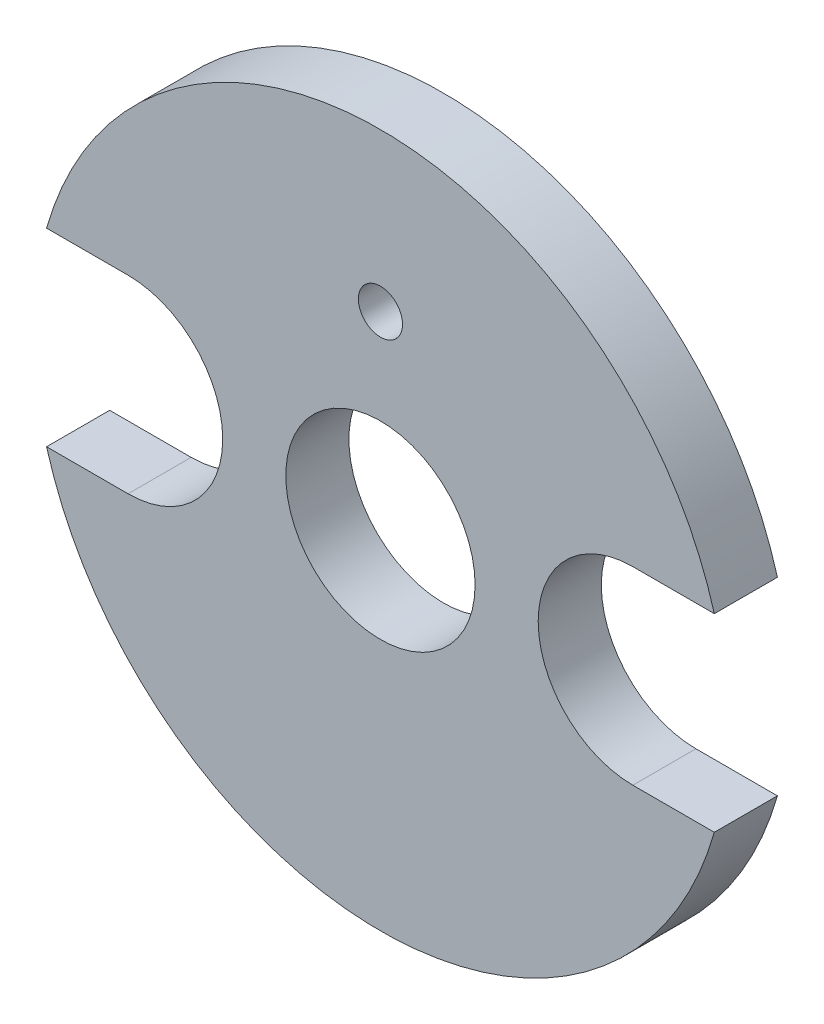
ISO-10303-21;
HEADER;
FILE_DESCRIPTION(('STEP AP214'),'2;1');
FILE_NAME('part.step','',(''),(''),'','','');
FILE_SCHEMA(('AUTOMOTIVE_DESIGN { 1 0 10303 214 1 1 1 1 }'));
ENDSEC;
DATA;
#1=APPLICATION_CONTEXT('core data for automotive mechanical design processes');
#2=APPLICATION_PROTOCOL_DEFINITION('international standard','automotive_design',2000,#1);
#3=PRODUCT_CONTEXT('',#1,'mechanical');
#4=PRODUCT('Part','Part','',(#3));
#5=PRODUCT_RELATED_PRODUCT_CATEGORY('part','',(#4));
#6=PRODUCT_DEFINITION_FORMATION('','',#4);
#7=PRODUCT_DEFINITION_CONTEXT('part definition',#1,'design');
#8=PRODUCT_DEFINITION('design','',#6,#7);
#9=PRODUCT_DEFINITION_SHAPE('','',#8);
#10=(LENGTH_UNIT() NAMED_UNIT(*) SI_UNIT(.MILLI.,.METRE.));
#11=(NAMED_UNIT(*) PLANE_ANGLE_UNIT() SI_UNIT($,.RADIAN.));
#12=(NAMED_UNIT(*) SI_UNIT($,.STERADIAN.) SOLID_ANGLE_UNIT());
#13=UNCERTAINTY_MEASURE_WITH_UNIT(LENGTH_MEASURE(1.E-05),#10,'distance_accuracy_value','');
#14=(GEOMETRIC_REPRESENTATION_CONTEXT(3) GLOBAL_UNCERTAINTY_ASSIGNED_CONTEXT((#13)) GLOBAL_UNIT_ASSIGNED_CONTEXT((#10,
#11,#12)) REPRESENTATION_CONTEXT('',''));
#15=CARTESIAN_POINT('',(0.,0.,0.));
#16=DIRECTION('',(0.,0.,1.));
#17=DIRECTION('',(1.,0.,0.));
#18=AXIS2_PLACEMENT_3D('',#15,#16,#17);
#19=CARTESIAN_POINT('',(0.,0.,2.));
#20=DIRECTION('',(0.,0.,1.));
#21=DIRECTION('',(1.,0.,0.));
#22=AXIS2_PLACEMENT_3D('',#19,#20,#21);
#23=PLANE('',#22);
#24=CARTESIAN_POINT('',(0.,6.,2.));
#25=DIRECTION('',(0.,0.,1.));
#26=DIRECTION('',(1.,0.,0.));
#27=AXIS2_PLACEMENT_3D('',#24,#25,#26);
#28=CIRCLE('',#27,0.699999999999999);
#29=CARTESIAN_POINT('',(0.699999999999999,6.,2.));
#30=VERTEX_POINT('',#29);
#31=EDGE_CURVE('E134',#30,#30,#28,.T.);
#32=ORIENTED_EDGE('',*,*,#31,.F.);
#33=EDGE_LOOP('',(#32));
#34=FACE_BOUND('',#33,.T.);
#35=CARTESIAN_POINT('',(0.,0.,2.));
#36=DIRECTION('',(0.,0.,1.));
#37=DIRECTION('',(1.,0.,0.));
#38=AXIS2_PLACEMENT_3D('',#35,#36,#37);
#39=CIRCLE('',#38,11.);
#40=CARTESIAN_POINT('',(10.5830052442584,3.00000000000011,2.));
#41=VERTEX_POINT('',#40);
#42=CARTESIAN_POINT('',(-10.5830052442584,3.00000000000011,2.));
#43=VERTEX_POINT('',#42);
#44=EDGE_CURVE('E145',#41,#43,#39,.T.);
#45=ORIENTED_EDGE('',*,*,#44,.T.);
#46=DIRECTION('',(1.,0.,0.));
#47=VECTOR('',#46,1.);
#48=CARTESIAN_POINT('',(-8.00000000000001,3.00000000000011,2.));
#49=LINE('',#48,#47);
#50=CARTESIAN_POINT('',(-8.00000000000001,3.,2.));
#51=VERTEX_POINT('',#50);
#52=EDGE_CURVE('E93',#43,#51,#49,.T.);
#53=ORIENTED_EDGE('',*,*,#52,.T.);
#54=CARTESIAN_POINT('',(-8.00000000000001,0.,2.));
#55=DIRECTION('',(0.,0.,-1.));
#56=DIRECTION('',(1.,0.,0.));
#57=AXIS2_PLACEMENT_3D('',#54,#55,#56);
#58=CIRCLE('',#57,3.);
#59=CARTESIAN_POINT('',(-8.00000000000001,-2.99999999999989,2.));
#60=VERTEX_POINT('',#59);
#61=EDGE_CURVE('E160',#51,#60,#58,.T.);
#62=ORIENTED_EDGE('',*,*,#61,.T.);
#63=DIRECTION('',(-1.,0.,0.));
#64=VECTOR('',#63,1.);
#65=CARTESIAN_POINT('',(-8.00000000000001,-2.99999999999989,2.));
#66=LINE('',#65,#64);
#67=CARTESIAN_POINT('',(-10.5830052442584,-2.99999999999989,2.));
#68=VERTEX_POINT('',#67);
#69=EDGE_CURVE('E173',#60,#68,#66,.T.);
#70=ORIENTED_EDGE('',*,*,#69,.T.);
#71=CARTESIAN_POINT('',(0.,0.,2.));
#72=DIRECTION('',(0.,0.,1.));
#73=DIRECTION('',(1.,0.,0.));
#74=AXIS2_PLACEMENT_3D('',#71,#72,#73);
#75=CIRCLE('',#74,11.);
#76=CARTESIAN_POINT('',(10.5830052442584,-2.99999999999989,2.));
#77=VERTEX_POINT('',#76);
#78=EDGE_CURVE('E112',#68,#77,#75,.T.);
#79=ORIENTED_EDGE('',*,*,#78,.T.);
#80=DIRECTION('',(-1.,0.,0.));
#81=VECTOR('',#80,1.);
#82=CARTESIAN_POINT('',(8.00000000000001,-2.99999999999989,2.));
#83=LINE('',#82,#81);
#84=CARTESIAN_POINT('',(8.00000000000001,-3.,2.));
#85=VERTEX_POINT('',#84);
#86=EDGE_CURVE('E106',#77,#85,#83,.T.);
#87=ORIENTED_EDGE('',*,*,#86,.T.);
#88=CARTESIAN_POINT('',(8.00000000000001,0.,2.));
#89=DIRECTION('',(0.,0.,-1.));
#90=DIRECTION('',(1.,0.,0.));
#91=AXIS2_PLACEMENT_3D('',#88,#89,#90);
#92=CIRCLE('',#91,3.);
#93=CARTESIAN_POINT('',(8.00000000000001,3.00000000000011,2.));
#94=VERTEX_POINT('',#93);
#95=EDGE_CURVE('E110',#85,#94,#92,.T.);
#96=ORIENTED_EDGE('',*,*,#95,.T.);
#97=DIRECTION('',(1.,0.,0.));
#98=VECTOR('',#97,1.);
#99=CARTESIAN_POINT('',(8.00000000000001,3.00000000000011,2.));
#100=LINE('',#99,#98);
#101=EDGE_CURVE('E50',#94,#41,#100,.T.);
#102=ORIENTED_EDGE('',*,*,#101,.T.);
#103=EDGE_LOOP('',(#45,#53,#62,#70,#79,#87,#96,#102));
#104=FACE_BOUND('',#103,.T.);
#105=CARTESIAN_POINT('',(0.,0.,2.));
#106=DIRECTION('',(0.,0.,1.));
#107=DIRECTION('',(1.,0.,0.));
#108=AXIS2_PLACEMENT_3D('',#105,#106,#107);
#109=CIRCLE('',#108,3.00000000000011);
#110=CARTESIAN_POINT('',(3.00000000000011,0.,2.));
#111=VERTEX_POINT('',#110);
#112=EDGE_CURVE('E182',#111,#111,#109,.T.);
#113=ORIENTED_EDGE('',*,*,#112,.F.);
#114=EDGE_LOOP('',(#113));
#115=FACE_BOUND('',#114,.T.);
#116=ADVANCED_FACE('F33',(#34,#104,#115),#23,.T.);
#117=CARTESIAN_POINT('',(0.,0.,0.));
#118=DIRECTION('',(0.,0.,1.));
#119=DIRECTION('',(1.,0.,0.));
#120=AXIS2_PLACEMENT_3D('',#117,#118,#119);
#121=PLANE('',#120);
#122=CARTESIAN_POINT('',(0.,6.,0.));
#123=DIRECTION('',(0.,0.,1.));
#124=DIRECTION('',(1.,0.,0.));
#125=AXIS2_PLACEMENT_3D('',#122,#123,#124);
#126=CIRCLE('',#125,0.699999999999999);
#127=CARTESIAN_POINT('',(0.699999999999999,6.,0.));
#128=VERTEX_POINT('',#127);
#129=EDGE_CURVE('E179',#128,#128,#126,.T.);
#130=ORIENTED_EDGE('',*,*,#129,.T.);
#131=EDGE_LOOP('',(#130));
#132=FACE_BOUND('',#131,.T.);
#133=CARTESIAN_POINT('',(0.,0.,0.));
#134=DIRECTION('',(0.,0.,1.));
#135=DIRECTION('',(1.,0.,0.));
#136=AXIS2_PLACEMENT_3D('',#133,#134,#135);
#137=CIRCLE('',#136,11.);
#138=CARTESIAN_POINT('',(10.5830052442584,3.00000000000011,0.));
#139=VERTEX_POINT('',#138);
#140=CARTESIAN_POINT('',(-10.5830052442584,3.00000000000011,0.));
#141=VERTEX_POINT('',#140);
#142=EDGE_CURVE('E130',#139,#141,#137,.T.);
#143=ORIENTED_EDGE('',*,*,#142,.F.);
#144=DIRECTION('',(1.,0.,0.));
#145=VECTOR('',#144,1.);
#146=CARTESIAN_POINT('',(8.00000000000001,3.00000000000011,0.));
#147=LINE('',#146,#145);
#148=CARTESIAN_POINT('',(8.00000000000001,3.00000000000011,0.));
#149=VERTEX_POINT('',#148);
#150=EDGE_CURVE('E85',#149,#139,#147,.T.);
#151=ORIENTED_EDGE('',*,*,#150,.F.);
#152=CARTESIAN_POINT('',(8.00000000000001,0.,0.));
#153=DIRECTION('',(0.,0.,-1.));
#154=DIRECTION('',(1.,0.,0.));
#155=AXIS2_PLACEMENT_3D('',#152,#153,#154);
#156=CIRCLE('',#155,3.);
#157=CARTESIAN_POINT('',(8.00000000000001,-3.,0.));
#158=VERTEX_POINT('',#157);
#159=EDGE_CURVE('E79',#158,#149,#156,.T.);
#160=ORIENTED_EDGE('',*,*,#159,.F.);
#161=DIRECTION('',(-1.,0.,0.));
#162=VECTOR('',#161,1.);
#163=CARTESIAN_POINT('',(8.00000000000001,-2.99999999999989,0.));
#164=LINE('',#163,#162);
#165=CARTESIAN_POINT('',(10.5830052442584,-2.99999999999989,0.));
#166=VERTEX_POINT('',#165);
#167=EDGE_CURVE('E120',#166,#158,#164,.T.);
#168=ORIENTED_EDGE('',*,*,#167,.F.);
#169=CARTESIAN_POINT('',(0.,0.,0.));
#170=DIRECTION('',(0.,0.,1.));
#171=DIRECTION('',(1.,0.,0.));
#172=AXIS2_PLACEMENT_3D('',#169,#170,#171);
#173=CIRCLE('',#172,11.);
#174=CARTESIAN_POINT('',(-10.5830052442584,-2.99999999999989,0.));
#175=VERTEX_POINT('',#174);
#176=EDGE_CURVE('E140',#175,#166,#173,.T.);
#177=ORIENTED_EDGE('',*,*,#176,.F.);
#178=DIRECTION('',(-1.,0.,0.));
#179=VECTOR('',#178,1.);
#180=CARTESIAN_POINT('',(-8.00000000000001,-2.99999999999989,0.));
#181=LINE('',#180,#179);
#182=CARTESIAN_POINT('',(-8.00000000000001,-2.99999999999989,0.));
#183=VERTEX_POINT('',#182);
#184=EDGE_CURVE('E138',#183,#175,#181,.T.);
#185=ORIENTED_EDGE('',*,*,#184,.F.);
#186=CARTESIAN_POINT('',(-8.00000000000001,0.,0.));
#187=DIRECTION('',(0.,0.,-1.));
#188=DIRECTION('',(1.,0.,0.));
#189=AXIS2_PLACEMENT_3D('',#186,#187,#188);
#190=CIRCLE('',#189,3.);
#191=CARTESIAN_POINT('',(-8.00000000000001,3.,0.));
#192=VERTEX_POINT('',#191);
#193=EDGE_CURVE('E136',#192,#183,#190,.T.);
#194=ORIENTED_EDGE('',*,*,#193,.F.);
#195=DIRECTION('',(1.,0.,0.));
#196=VECTOR('',#195,1.);
#197=CARTESIAN_POINT('',(-8.00000000000001,3.00000000000011,0.));
#198=LINE('',#197,#196);
#199=EDGE_CURVE('E133',#141,#192,#198,.T.);
#200=ORIENTED_EDGE('',*,*,#199,.F.);
#201=EDGE_LOOP('',(#143,#151,#160,#168,#177,#185,#194,#200));
#202=FACE_BOUND('',#201,.T.);
#203=CARTESIAN_POINT('',(0.,0.,0.));
#204=DIRECTION('',(0.,0.,1.));
#205=DIRECTION('',(1.,0.,0.));
#206=AXIS2_PLACEMENT_3D('',#203,#204,#205);
#207=CIRCLE('',#206,3.00000000000011);
#208=CARTESIAN_POINT('',(3.00000000000011,0.,0.));
#209=VERTEX_POINT('',#208);
#210=EDGE_CURVE('E185',#209,#209,#207,.T.);
#211=ORIENTED_EDGE('',*,*,#210,.T.);
#212=EDGE_LOOP('',(#211));
#213=FACE_BOUND('',#212,.T.);
#214=ADVANCED_FACE('F164',(#132,#202,#213),#121,.F.);
#215=CARTESIAN_POINT('',(0.,0.,2.));
#216=DIRECTION('',(0.,0.,-1.));
#217=DIRECTION('',(-1.,0.,0.));
#218=AXIS2_PLACEMENT_3D('',#215,#216,#217);
#219=CYLINDRICAL_SURFACE('',#218,11.);
#220=ORIENTED_EDGE('',*,*,#142,.T.);
#221=DIRECTION('',(0.,0.,-1.));
#222=VECTOR('',#221,1.);
#223=CARTESIAN_POINT('',(-10.5830052442584,3.00000000000011,2.));
#224=LINE('',#223,#222);
#225=EDGE_CURVE('E11',#43,#141,#224,.T.);
#226=ORIENTED_EDGE('',*,*,#225,.F.);
#227=ORIENTED_EDGE('',*,*,#44,.F.);
#228=DIRECTION('',(0.,0.,-1.));
#229=VECTOR('',#228,1.);
#230=CARTESIAN_POINT('',(10.5830052442584,3.00000000000011,2.));
#231=LINE('',#230,#229);
#232=EDGE_CURVE('E126',#41,#139,#231,.T.);
#233=ORIENTED_EDGE('',*,*,#232,.T.);
#234=EDGE_LOOP('',(#220,#226,#227,#233));
#235=FACE_BOUND('',#234,.T.);
#236=ADVANCED_FACE('F35',(#235),#219,.T.);
#237=CARTESIAN_POINT('',(-8.00000000000001,3.00000000000011,2.));
#238=DIRECTION('',(0.,1.,0.));
#239=DIRECTION('',(0.,0.,1.));
#240=AXIS2_PLACEMENT_3D('',#237,#238,#239);
#241=PLANE('',#240);
#242=ORIENTED_EDGE('',*,*,#199,.T.);
#243=DIRECTION('',(0.,0.,-1.));
#244=VECTOR('',#243,1.);
#245=CARTESIAN_POINT('',(-8.00000000000001,3.,2.));
#246=LINE('',#245,#244);
#247=EDGE_CURVE('E42',#51,#192,#246,.T.);
#248=ORIENTED_EDGE('',*,*,#247,.F.);
#249=ORIENTED_EDGE('',*,*,#52,.F.);
#250=ORIENTED_EDGE('',*,*,#225,.T.);
#251=EDGE_LOOP('',(#242,#248,#249,#250));
#252=FACE_BOUND('',#251,.T.);
#253=ADVANCED_FACE('F218',(#252),#241,.F.);
#254=CARTESIAN_POINT('',(-8.00000000000001,0.,2.));
#255=DIRECTION('',(0.,0.,-1.));
#256=DIRECTION('',(-1.,0.,0.));
#257=AXIS2_PLACEMENT_3D('',#254,#255,#256);
#258=CYLINDRICAL_SURFACE('',#257,3.);
#259=ORIENTED_EDGE('',*,*,#193,.T.);
#260=DIRECTION('',(0.,0.,-1.));
#261=VECTOR('',#260,1.);
#262=CARTESIAN_POINT('',(-8.00000000000001,-2.99999999999989,2.));
#263=LINE('',#262,#261);
#264=EDGE_CURVE('E152',#60,#183,#263,.T.);
#265=ORIENTED_EDGE('',*,*,#264,.F.);
#266=ORIENTED_EDGE('',*,*,#61,.F.);
#267=ORIENTED_EDGE('',*,*,#247,.T.);
#268=EDGE_LOOP('',(#259,#265,#266,#267));
#269=FACE_BOUND('',#268,.T.);
#270=ADVANCED_FACE('F158',(#269),#258,.F.);
#271=CARTESIAN_POINT('',(-8.00000000000001,-2.99999999999989,2.));
#272=DIRECTION('',(0.,-1.,0.));
#273=DIRECTION('',(0.,0.,-1.));
#274=AXIS2_PLACEMENT_3D('',#271,#272,#273);
#275=PLANE('',#274);
#276=ORIENTED_EDGE('',*,*,#184,.T.);
#277=DIRECTION('',(0.,0.,-1.));
#278=VECTOR('',#277,1.);
#279=CARTESIAN_POINT('',(-10.5830052442584,-2.99999999999989,2.));
#280=LINE('',#279,#278);
#281=EDGE_CURVE('E149',#68,#175,#280,.T.);
#282=ORIENTED_EDGE('',*,*,#281,.F.);
#283=ORIENTED_EDGE('',*,*,#69,.F.);
#284=ORIENTED_EDGE('',*,*,#264,.T.);
#285=EDGE_LOOP('',(#276,#282,#283,#284));
#286=FACE_BOUND('',#285,.T.);
#287=ADVANCED_FACE('F169',(#286),#275,.F.);
#288=CARTESIAN_POINT('',(0.,0.,2.));
#289=DIRECTION('',(0.,0.,-1.));
#290=DIRECTION('',(-1.,0.,0.));
#291=AXIS2_PLACEMENT_3D('',#288,#289,#290);
#292=CYLINDRICAL_SURFACE('',#291,11.);
#293=ORIENTED_EDGE('',*,*,#176,.T.);
#294=DIRECTION('',(0.,0.,-1.));
#295=VECTOR('',#294,1.);
#296=CARTESIAN_POINT('',(10.5830052442584,-2.99999999999989,2.));
#297=LINE('',#296,#295);
#298=EDGE_CURVE('E121',#77,#166,#297,.T.);
#299=ORIENTED_EDGE('',*,*,#298,.F.);
#300=ORIENTED_EDGE('',*,*,#78,.F.);
#301=ORIENTED_EDGE('',*,*,#281,.T.);
#302=EDGE_LOOP('',(#293,#299,#300,#301));
#303=FACE_BOUND('',#302,.T.);
#304=ADVANCED_FACE('F172',(#303),#292,.T.);
#305=CARTESIAN_POINT('',(8.00000000000001,-2.99999999999989,2.));
#306=DIRECTION('',(0.,-1.,0.));
#307=DIRECTION('',(0.,0.,-1.));
#308=AXIS2_PLACEMENT_3D('',#305,#306,#307);
#309=PLANE('',#308);
#310=ORIENTED_EDGE('',*,*,#167,.T.);
#311=DIRECTION('',(0.,0.,-1.));
#312=VECTOR('',#311,1.);
#313=CARTESIAN_POINT('',(8.00000000000001,-3.,2.));
#314=LINE('',#313,#312);
#315=EDGE_CURVE('E117',#85,#158,#314,.T.);
#316=ORIENTED_EDGE('',*,*,#315,.F.);
#317=ORIENTED_EDGE('',*,*,#86,.F.);
#318=ORIENTED_EDGE('',*,*,#298,.T.);
#319=EDGE_LOOP('',(#310,#316,#317,#318));
#320=FACE_BOUND('',#319,.T.);
#321=ADVANCED_FACE('F118',(#320),#309,.F.);
#322=CARTESIAN_POINT('',(8.00000000000001,0.,2.));
#323=DIRECTION('',(0.,0.,-1.));
#324=DIRECTION('',(-1.,0.,0.));
#325=AXIS2_PLACEMENT_3D('',#322,#323,#324);
#326=CYLINDRICAL_SURFACE('',#325,3.);
#327=ORIENTED_EDGE('',*,*,#159,.T.);
#328=DIRECTION('',(0.,0.,-1.));
#329=VECTOR('',#328,1.);
#330=CARTESIAN_POINT('',(8.00000000000001,3.00000000000011,2.));
#331=LINE('',#330,#329);
#332=EDGE_CURVE('E122',#94,#149,#331,.T.);
#333=ORIENTED_EDGE('',*,*,#332,.F.);
#334=ORIENTED_EDGE('',*,*,#95,.F.);
#335=ORIENTED_EDGE('',*,*,#315,.T.);
#336=EDGE_LOOP('',(#327,#333,#334,#335));
#337=FACE_BOUND('',#336,.T.);
#338=ADVANCED_FACE('F124',(#337),#326,.F.);
#339=CARTESIAN_POINT('',(8.00000000000001,3.00000000000011,2.));
#340=DIRECTION('',(0.,1.,0.));
#341=DIRECTION('',(0.,0.,1.));
#342=AXIS2_PLACEMENT_3D('',#339,#340,#341);
#343=PLANE('',#342);
#344=ORIENTED_EDGE('',*,*,#150,.T.);
#345=ORIENTED_EDGE('',*,*,#232,.F.);
#346=ORIENTED_EDGE('',*,*,#101,.F.);
#347=ORIENTED_EDGE('',*,*,#332,.T.);
#348=EDGE_LOOP('',(#344,#345,#346,#347));
#349=FACE_BOUND('',#348,.T.);
#350=ADVANCED_FACE('F206',(#349),#343,.F.);
#351=CARTESIAN_POINT('',(0.,6.,2.));
#352=DIRECTION('',(0.,0.,-1.));
#353=DIRECTION('',(-1.,0.,0.));
#354=AXIS2_PLACEMENT_3D('',#351,#352,#353);
#355=CYLINDRICAL_SURFACE('',#354,0.699999999999999);
#356=ORIENTED_EDGE('',*,*,#31,.T.);
#357=EDGE_LOOP('',(#356));
#358=FACE_BOUND('',#357,.T.);
#359=ORIENTED_EDGE('',*,*,#129,.F.);
#360=EDGE_LOOP('',(#359));
#361=FACE_BOUND('',#360,.T.);
#362=ADVANCED_FACE('F203',(#358,#361),#355,.F.);
#363=CARTESIAN_POINT('',(0.,0.,2.));
#364=DIRECTION('',(0.,0.,-1.));
#365=DIRECTION('',(-1.,0.,0.));
#366=AXIS2_PLACEMENT_3D('',#363,#364,#365);
#367=CYLINDRICAL_SURFACE('',#366,3.00000000000011);
#368=ORIENTED_EDGE('',*,*,#112,.T.);
#369=EDGE_LOOP('',(#368));
#370=FACE_BOUND('',#369,.T.);
#371=ORIENTED_EDGE('',*,*,#210,.F.);
#372=EDGE_LOOP('',(#371));
#373=FACE_BOUND('',#372,.T.);
#374=ADVANCED_FACE('F191',(#370,#373),#367,.F.);
#375=CLOSED_SHELL('',(#116,#214,#236,#253,#270,#287,#304,#321,#338,#350,#362,#374));
#376=MANIFOLD_SOLID_BREP('B2',#375);
#377=ADVANCED_BREP_SHAPE_REPRESENTATION('',(#18,#376),#14);
#378=SHAPE_DEFINITION_REPRESENTATION(#9,#377);
ENDSEC;
END-ISO-10303-21;
